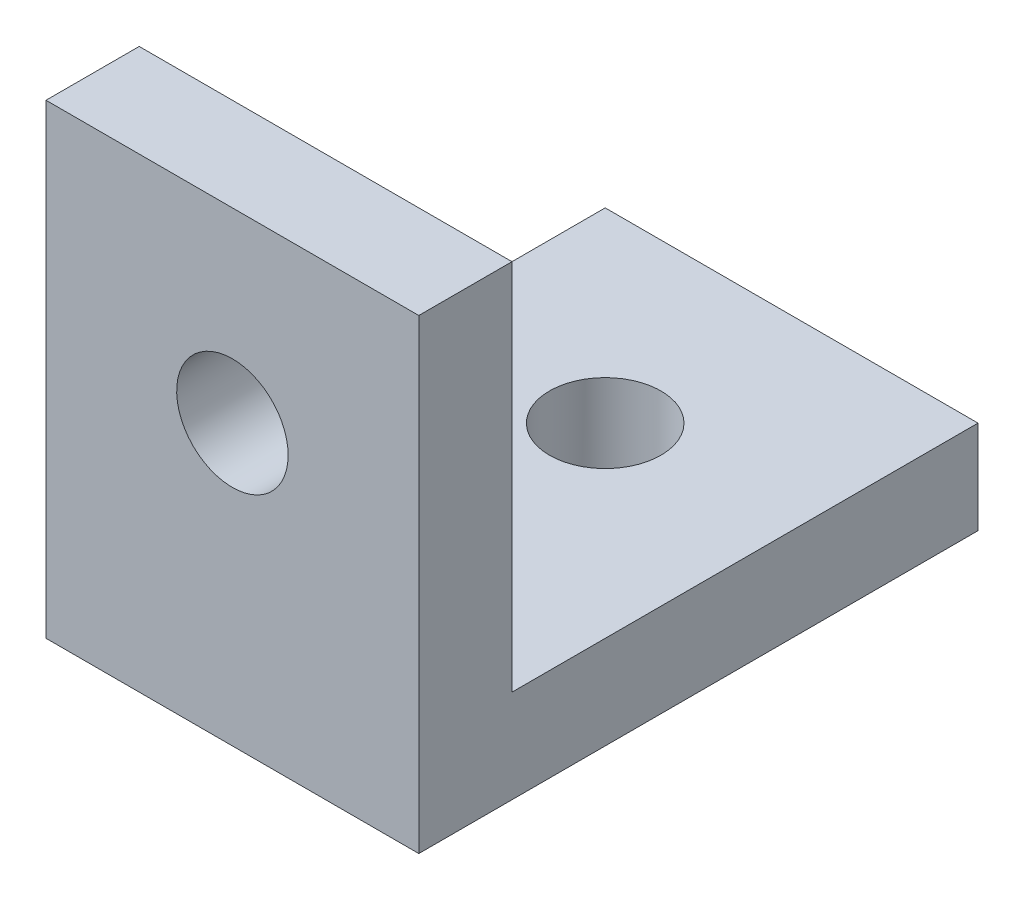
ISO-10303-21;
HEADER;
FILE_DESCRIPTION(('STEP AP214'),'2;1');
FILE_NAME('part.step','',(''),(''),'','','');
FILE_SCHEMA(('AUTOMOTIVE_DESIGN { 1 0 10303 214 1 1 1 1 }'));
ENDSEC;
DATA;
#1=APPLICATION_CONTEXT('core data for automotive mechanical design processes');
#2=APPLICATION_PROTOCOL_DEFINITION('international standard','automotive_design',2000,#1);
#3=PRODUCT_CONTEXT('',#1,'mechanical');
#4=PRODUCT('Part','Part','',(#3));
#5=PRODUCT_RELATED_PRODUCT_CATEGORY('part','',(#4));
#6=PRODUCT_DEFINITION_FORMATION('','',#4);
#7=PRODUCT_DEFINITION_CONTEXT('part definition',#1,'design');
#8=PRODUCT_DEFINITION('design','',#6,#7);
#9=PRODUCT_DEFINITION_SHAPE('','',#8);
#10=(LENGTH_UNIT() NAMED_UNIT(*) SI_UNIT(.MILLI.,.METRE.));
#11=(NAMED_UNIT(*) PLANE_ANGLE_UNIT() SI_UNIT($,.RADIAN.));
#12=(NAMED_UNIT(*) SI_UNIT($,.STERADIAN.) SOLID_ANGLE_UNIT());
#13=UNCERTAINTY_MEASURE_WITH_UNIT(LENGTH_MEASURE(1.E-05),#10,'distance_accuracy_value','');
#14=(GEOMETRIC_REPRESENTATION_CONTEXT(3) GLOBAL_UNCERTAINTY_ASSIGNED_CONTEXT((#13)) GLOBAL_UNIT_ASSIGNED_CONTEXT((#10,
#11,#12)) REPRESENTATION_CONTEXT('',''));
#15=CARTESIAN_POINT('',(0.,0.,0.));
#16=DIRECTION('',(0.,0.,1.));
#17=DIRECTION('',(1.,0.,0.));
#18=AXIS2_PLACEMENT_3D('',#15,#16,#17);
#19=CARTESIAN_POINT('',(6.35,0.,-19.05));
#20=DIRECTION('',(0.,-1.,0.));
#21=DIRECTION('',(0.,0.,-1.));
#22=AXIS2_PLACEMENT_3D('',#19,#20,#21);
#23=PLANE('',#22);
#24=CARTESIAN_POINT('',(0.,0.,-12.7));
#25=DIRECTION('',(0.,-1.,0.));
#26=DIRECTION('',(0.,0.,-1.));
#27=AXIS2_PLACEMENT_3D('',#24,#25,#26);
#28=CIRCLE('',#27,1.89865);
#29=CARTESIAN_POINT('',(0.,0.,-14.59865));
#30=VERTEX_POINT('',#29);
#31=EDGE_CURVE('E106',#30,#30,#28,.T.);
#32=ORIENTED_EDGE('',*,*,#31,.F.);
#33=EDGE_LOOP('',(#32));
#34=FACE_BOUND('',#33,.T.);
#35=DIRECTION('',(-1.,0.,0.));
#36=VECTOR('',#35,1.);
#37=CARTESIAN_POINT('',(6.35,0.,0.));
#38=LINE('',#37,#36);
#39=CARTESIAN_POINT('',(6.35,0.,0.));
#40=VERTEX_POINT('',#39);
#41=CARTESIAN_POINT('',(-6.35,0.,0.));
#42=VERTEX_POINT('',#41);
#43=EDGE_CURVE('E84',#40,#42,#38,.T.);
#44=ORIENTED_EDGE('',*,*,#43,.T.);
#45=DIRECTION('',(0.,0.,1.));
#46=VECTOR('',#45,1.);
#47=CARTESIAN_POINT('',(-6.35,0.,-19.05));
#48=LINE('',#47,#46);
#49=CARTESIAN_POINT('',(-6.35,0.,-19.05));
#50=VERTEX_POINT('',#49);
#51=EDGE_CURVE('E87',#50,#42,#48,.T.);
#52=ORIENTED_EDGE('',*,*,#51,.F.);
#53=DIRECTION('',(-1.,0.,0.));
#54=VECTOR('',#53,1.);
#55=CARTESIAN_POINT('',(6.35,0.,-19.05));
#56=LINE('',#55,#54);
#57=CARTESIAN_POINT('',(6.35,0.,-19.05));
#58=VERTEX_POINT('',#57);
#59=EDGE_CURVE('E11',#58,#50,#56,.T.);
#60=ORIENTED_EDGE('',*,*,#59,.F.);
#61=DIRECTION('',(0.,0.,1.));
#62=VECTOR('',#61,1.);
#63=CARTESIAN_POINT('',(6.35,0.,-19.05));
#64=LINE('',#63,#62);
#65=EDGE_CURVE('E88',#58,#40,#64,.T.);
#66=ORIENTED_EDGE('',*,*,#65,.T.);
#67=EDGE_LOOP('',(#44,#52,#60,#66));
#68=FACE_BOUND('',#67,.T.);
#69=ADVANCED_FACE('F34',(#34,#68),#23,.T.);
#70=CARTESIAN_POINT('',(6.35,3.175,-19.05));
#71=DIRECTION('',(0.,0.,-1.));
#72=DIRECTION('',(-1.,0.,0.));
#73=AXIS2_PLACEMENT_3D('',#70,#71,#72);
#74=PLANE('',#73);
#75=ORIENTED_EDGE('',*,*,#59,.T.);
#76=DIRECTION('',(0.,-1.,0.));
#77=VECTOR('',#76,1.);
#78=CARTESIAN_POINT('',(-6.35,3.175,-19.05));
#79=LINE('',#78,#77);
#80=CARTESIAN_POINT('',(-6.35,3.175,-19.05));
#81=VERTEX_POINT('',#80);
#82=EDGE_CURVE('E105',#81,#50,#79,.T.);
#83=ORIENTED_EDGE('',*,*,#82,.F.);
#84=DIRECTION('',(-1.,0.,0.));
#85=VECTOR('',#84,1.);
#86=CARTESIAN_POINT('',(6.35,3.175,-19.05));
#87=LINE('',#86,#85);
#88=CARTESIAN_POINT('',(6.35,3.175,-19.05));
#89=VERTEX_POINT('',#88);
#90=EDGE_CURVE('E42',#89,#81,#87,.T.);
#91=ORIENTED_EDGE('',*,*,#90,.F.);
#92=DIRECTION('',(0.,-1.,0.));
#93=VECTOR('',#92,1.);
#94=CARTESIAN_POINT('',(6.35,3.175,-19.05));
#95=LINE('',#94,#93);
#96=EDGE_CURVE('E93',#89,#58,#95,.T.);
#97=ORIENTED_EDGE('',*,*,#96,.T.);
#98=EDGE_LOOP('',(#75,#83,#91,#97));
#99=FACE_BOUND('',#98,.T.);
#100=ADVANCED_FACE('F151',(#99),#74,.T.);
#101=CARTESIAN_POINT('',(6.35,3.175,-3.175));
#102=DIRECTION('',(0.,1.,0.));
#103=DIRECTION('',(0.,0.,1.));
#104=AXIS2_PLACEMENT_3D('',#101,#102,#103);
#105=PLANE('',#104);
#106=CARTESIAN_POINT('',(0.,3.175,-12.7));
#107=DIRECTION('',(0.,1.,0.));
#108=DIRECTION('',(0.,0.,1.));
#109=AXIS2_PLACEMENT_3D('',#106,#107,#108);
#110=CIRCLE('',#109,1.89865);
#111=CARTESIAN_POINT('',(0.,3.175,-10.80135));
#112=VERTEX_POINT('',#111);
#113=EDGE_CURVE('E109',#112,#112,#110,.T.);
#114=ORIENTED_EDGE('',*,*,#113,.F.);
#115=EDGE_LOOP('',(#114));
#116=FACE_BOUND('',#115,.T.);
#117=ORIENTED_EDGE('',*,*,#90,.T.);
#118=DIRECTION('',(0.,0.,-1.));
#119=VECTOR('',#118,1.);
#120=CARTESIAN_POINT('',(-6.35,3.175,-3.175));
#121=LINE('',#120,#119);
#122=CARTESIAN_POINT('',(-6.35,3.175,-3.175));
#123=VERTEX_POINT('',#122);
#124=EDGE_CURVE('E117',#123,#81,#121,.T.);
#125=ORIENTED_EDGE('',*,*,#124,.F.);
#126=DIRECTION('',(-1.,0.,0.));
#127=VECTOR('',#126,1.);
#128=CARTESIAN_POINT('',(6.35,3.175,-3.175));
#129=LINE('',#128,#127);
#130=CARTESIAN_POINT('',(6.35,3.175,-3.175));
#131=VERTEX_POINT('',#130);
#132=EDGE_CURVE('E133',#131,#123,#129,.T.);
#133=ORIENTED_EDGE('',*,*,#132,.F.);
#134=DIRECTION('',(0.,0.,-1.));
#135=VECTOR('',#134,1.);
#136=CARTESIAN_POINT('',(6.35,3.175,-3.175));
#137=LINE('',#136,#135);
#138=EDGE_CURVE('E129',#131,#89,#137,.T.);
#139=ORIENTED_EDGE('',*,*,#138,.T.);
#140=EDGE_LOOP('',(#117,#125,#133,#139));
#141=FACE_BOUND('',#140,.T.);
#142=ADVANCED_FACE('F147',(#116,#141),#105,.T.);
#143=CARTESIAN_POINT('',(6.35,15.875,-3.175));
#144=DIRECTION('',(0.,0.,-1.));
#145=DIRECTION('',(0.,1.,0.));
#146=AXIS2_PLACEMENT_3D('',#143,#144,#145);
#147=PLANE('',#146);
#148=CARTESIAN_POINT('',(0.,9.525,-3.175));
#149=DIRECTION('',(0.,0.,-1.));
#150=DIRECTION('',(0.,1.,0.));
#151=AXIS2_PLACEMENT_3D('',#148,#149,#150);
#152=CIRCLE('',#151,1.89865);
#153=CARTESIAN_POINT('',(0.,11.42365,-3.175));
#154=VERTEX_POINT('',#153);
#155=EDGE_CURVE('E176',#154,#154,#152,.T.);
#156=ORIENTED_EDGE('',*,*,#155,.F.);
#157=EDGE_LOOP('',(#156));
#158=FACE_BOUND('',#157,.T.);
#159=ORIENTED_EDGE('',*,*,#132,.T.);
#160=DIRECTION('',(0.,-1.,0.));
#161=VECTOR('',#160,1.);
#162=CARTESIAN_POINT('',(-6.35,15.875,-3.175));
#163=LINE('',#162,#161);
#164=CARTESIAN_POINT('',(-6.35,15.875,-3.175));
#165=VERTEX_POINT('',#164);
#166=EDGE_CURVE('E114',#165,#123,#163,.T.);
#167=ORIENTED_EDGE('',*,*,#166,.F.);
#168=DIRECTION('',(-1.,0.,0.));
#169=VECTOR('',#168,1.);
#170=CARTESIAN_POINT('',(6.35,15.875,-3.175));
#171=LINE('',#170,#169);
#172=CARTESIAN_POINT('',(6.35,15.875,-3.175));
#173=VERTEX_POINT('',#172);
#174=EDGE_CURVE('E135',#173,#165,#171,.T.);
#175=ORIENTED_EDGE('',*,*,#174,.F.);
#176=DIRECTION('',(0.,-1.,0.));
#177=VECTOR('',#176,1.);
#178=CARTESIAN_POINT('',(6.35,15.875,-3.175));
#179=LINE('',#178,#177);
#180=EDGE_CURVE('E126',#173,#131,#179,.T.);
#181=ORIENTED_EDGE('',*,*,#180,.T.);
#182=EDGE_LOOP('',(#159,#167,#175,#181));
#183=FACE_BOUND('',#182,.T.);
#184=ADVANCED_FACE('F144',(#158,#183),#147,.T.);
#185=CARTESIAN_POINT('',(6.35,15.875,0.));
#186=DIRECTION('',(0.,1.,0.));
#187=DIRECTION('',(0.,0.,1.));
#188=AXIS2_PLACEMENT_3D('',#185,#186,#187);
#189=PLANE('',#188);
#190=ORIENTED_EDGE('',*,*,#174,.T.);
#191=DIRECTION('',(0.,0.,-1.));
#192=VECTOR('',#191,1.);
#193=CARTESIAN_POINT('',(-6.35,15.875,0.));
#194=LINE('',#193,#192);
#195=CARTESIAN_POINT('',(-6.35,15.875,0.));
#196=VERTEX_POINT('',#195);
#197=EDGE_CURVE('E100',#196,#165,#194,.T.);
#198=ORIENTED_EDGE('',*,*,#197,.F.);
#199=DIRECTION('',(-1.,0.,0.));
#200=VECTOR('',#199,1.);
#201=CARTESIAN_POINT('',(6.35,15.875,0.));
#202=LINE('',#201,#200);
#203=CARTESIAN_POINT('',(6.35,15.875,0.));
#204=VERTEX_POINT('',#203);
#205=EDGE_CURVE('E92',#204,#196,#202,.T.);
#206=ORIENTED_EDGE('',*,*,#205,.F.);
#207=DIRECTION('',(0.,0.,-1.));
#208=VECTOR('',#207,1.);
#209=CARTESIAN_POINT('',(6.35,15.875,0.));
#210=LINE('',#209,#208);
#211=EDGE_CURVE('E123',#204,#173,#210,.T.);
#212=ORIENTED_EDGE('',*,*,#211,.T.);
#213=EDGE_LOOP('',(#190,#198,#206,#212));
#214=FACE_BOUND('',#213,.T.);
#215=ADVANCED_FACE('F138',(#214),#189,.T.);
#216=CARTESIAN_POINT('',(6.35,0.,0.));
#217=DIRECTION('',(0.,0.,1.));
#218=DIRECTION('',(1.,0.,0.));
#219=AXIS2_PLACEMENT_3D('',#216,#217,#218);
#220=PLANE('',#219);
#221=CARTESIAN_POINT('',(0.,9.525,0.));
#222=DIRECTION('',(0.,0.,1.));
#223=DIRECTION('',(1.,0.,0.));
#224=AXIS2_PLACEMENT_3D('',#221,#222,#223);
#225=CIRCLE('',#224,1.89865);
#226=CARTESIAN_POINT('',(1.89865,9.525,0.));
#227=VERTEX_POINT('',#226);
#228=EDGE_CURVE('E37',#227,#227,#225,.T.);
#229=ORIENTED_EDGE('',*,*,#228,.F.);
#230=EDGE_LOOP('',(#229));
#231=FACE_BOUND('',#230,.T.);
#232=ORIENTED_EDGE('',*,*,#205,.T.);
#233=DIRECTION('',(0.,1.,0.));
#234=VECTOR('',#233,1.);
#235=CARTESIAN_POINT('',(-6.35,0.,0.));
#236=LINE('',#235,#234);
#237=EDGE_CURVE('E95',#42,#196,#236,.T.);
#238=ORIENTED_EDGE('',*,*,#237,.F.);
#239=ORIENTED_EDGE('',*,*,#43,.F.);
#240=DIRECTION('',(0.,1.,0.));
#241=VECTOR('',#240,1.);
#242=CARTESIAN_POINT('',(6.35,0.,0.));
#243=LINE('',#242,#241);
#244=EDGE_CURVE('E121',#40,#204,#243,.T.);
#245=ORIENTED_EDGE('',*,*,#244,.T.);
#246=EDGE_LOOP('',(#232,#238,#239,#245));
#247=FACE_BOUND('',#246,.T.);
#248=ADVANCED_FACE('F96',(#231,#247),#220,.T.);
#249=CARTESIAN_POINT('',(6.35,0.,0.));
#250=DIRECTION('',(-1.,0.,0.));
#251=DIRECTION('',(0.,0.,1.));
#252=AXIS2_PLACEMENT_3D('',#249,#250,#251);
#253=PLANE('',#252);
#254=ORIENTED_EDGE('',*,*,#65,.F.);
#255=ORIENTED_EDGE('',*,*,#96,.F.);
#256=ORIENTED_EDGE('',*,*,#138,.F.);
#257=ORIENTED_EDGE('',*,*,#180,.F.);
#258=ORIENTED_EDGE('',*,*,#211,.F.);
#259=ORIENTED_EDGE('',*,*,#244,.F.);
#260=EDGE_LOOP('',(#254,#255,#256,#257,#258,#259));
#261=FACE_BOUND('',#260,.T.);
#262=ADVANCED_FACE('F150',(#261),#253,.F.);
#263=CARTESIAN_POINT('',(-6.35,0.,0.));
#264=DIRECTION('',(-1.,0.,0.));
#265=DIRECTION('',(0.,0.,1.));
#266=AXIS2_PLACEMENT_3D('',#263,#264,#265);
#267=PLANE('',#266);
#268=ORIENTED_EDGE('',*,*,#51,.T.);
#269=ORIENTED_EDGE('',*,*,#237,.T.);
#270=ORIENTED_EDGE('',*,*,#197,.T.);
#271=ORIENTED_EDGE('',*,*,#166,.T.);
#272=ORIENTED_EDGE('',*,*,#124,.T.);
#273=ORIENTED_EDGE('',*,*,#82,.T.);
#274=EDGE_LOOP('',(#268,#269,#270,#271,#272,#273));
#275=FACE_BOUND('',#274,.T.);
#276=ADVANCED_FACE('F103',(#275),#267,.T.);
#277=CARTESIAN_POINT('',(0.,3.175,-12.7));
#278=DIRECTION('',(0.,1.,0.));
#279=DIRECTION('',(0.,0.,1.));
#280=AXIS2_PLACEMENT_3D('',#277,#278,#279);
#281=CYLINDRICAL_SURFACE('',#280,1.89865);
#282=ORIENTED_EDGE('',*,*,#31,.T.);
#283=EDGE_LOOP('',(#282));
#284=FACE_BOUND('',#283,.T.);
#285=ORIENTED_EDGE('',*,*,#113,.T.);
#286=EDGE_LOOP('',(#285));
#287=FACE_BOUND('',#286,.T.);
#288=ADVANCED_FACE('F184',(#284,#287),#281,.F.);
#289=CARTESIAN_POINT('',(0.,9.525,-3.175));
#290=DIRECTION('',(0.,0.,-1.));
#291=DIRECTION('',(0.,1.,0.));
#292=AXIS2_PLACEMENT_3D('',#289,#290,#291);
#293=CYLINDRICAL_SURFACE('',#292,1.89865);
#294=ORIENTED_EDGE('',*,*,#228,.T.);
#295=EDGE_LOOP('',(#294));
#296=FACE_BOUND('',#295,.T.);
#297=ORIENTED_EDGE('',*,*,#155,.T.);
#298=EDGE_LOOP('',(#297));
#299=FACE_BOUND('',#298,.T.);
#300=ADVANCED_FACE('F182',(#296,#299),#293,.F.);
#301=CLOSED_SHELL('',(#69,#100,#142,#184,#215,#248,#262,#276,#288,#300));
#302=MANIFOLD_SOLID_BREP('B2',#301);
#303=ADVANCED_BREP_SHAPE_REPRESENTATION('',(#18,#302),#14);
#304=SHAPE_DEFINITION_REPRESENTATION(#9,#303);
ENDSEC;
END-ISO-10303-21;
